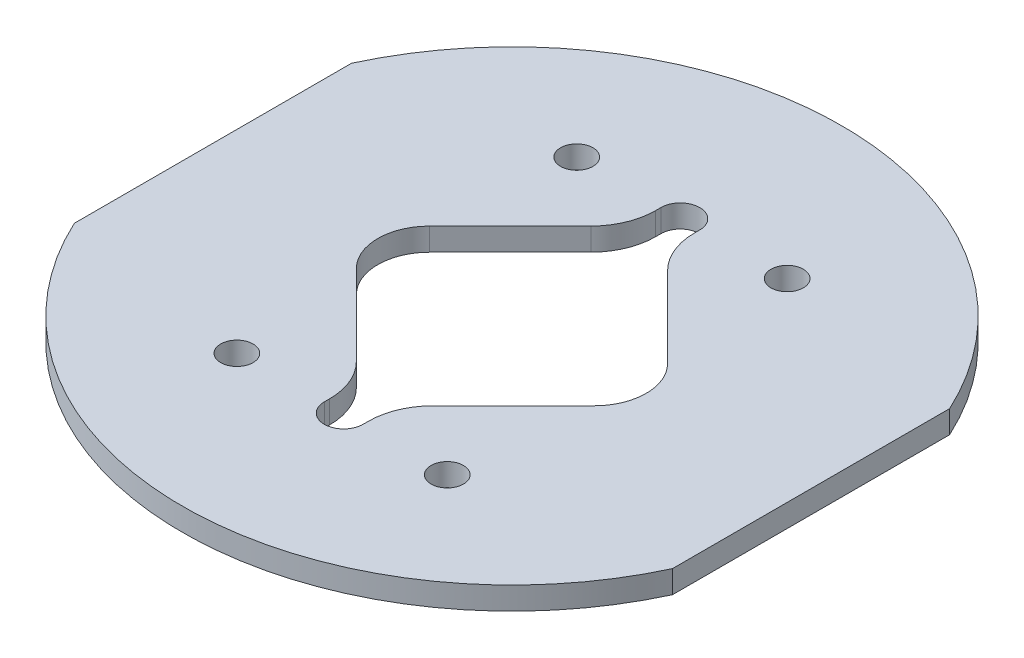
ISO-10303-21;
HEADER;
FILE_DESCRIPTION(('STEP AP214'),'2;1');
FILE_NAME('part.step','',(''),(''),'','','');
FILE_SCHEMA(('AUTOMOTIVE_DESIGN { 1 0 10303 214 1 1 1 1 }'));
ENDSEC;
DATA;
#1=APPLICATION_CONTEXT('core data for automotive mechanical design processes');
#2=APPLICATION_PROTOCOL_DEFINITION('international standard','automotive_design',2000,#1);
#3=PRODUCT_CONTEXT('',#1,'mechanical');
#4=PRODUCT('Part','Part','',(#3));
#5=PRODUCT_RELATED_PRODUCT_CATEGORY('part','',(#4));
#6=PRODUCT_DEFINITION_FORMATION('','',#4);
#7=PRODUCT_DEFINITION_CONTEXT('part definition',#1,'design');
#8=PRODUCT_DEFINITION('design','',#6,#7);
#9=PRODUCT_DEFINITION_SHAPE('','',#8);
#10=(LENGTH_UNIT() NAMED_UNIT(*) SI_UNIT(.MILLI.,.METRE.));
#11=(NAMED_UNIT(*) PLANE_ANGLE_UNIT() SI_UNIT($,.RADIAN.));
#12=(NAMED_UNIT(*) SI_UNIT($,.STERADIAN.) SOLID_ANGLE_UNIT());
#13=UNCERTAINTY_MEASURE_WITH_UNIT(LENGTH_MEASURE(1.E-05),#10,'distance_accuracy_value','');
#14=(GEOMETRIC_REPRESENTATION_CONTEXT(3) GLOBAL_UNCERTAINTY_ASSIGNED_CONTEXT((#13)) GLOBAL_UNIT_ASSIGNED_CONTEXT((#10,
#11,#12)) REPRESENTATION_CONTEXT('',''));
#15=CARTESIAN_POINT('',(0.,0.,0.));
#16=DIRECTION('',(0.,0.,1.));
#17=DIRECTION('',(1.,0.,0.));
#18=AXIS2_PLACEMENT_3D('',#15,#16,#17);
#19=CARTESIAN_POINT('',(0.,1.75,0.));
#20=DIRECTION('',(0.,-1.,0.));
#21=DIRECTION('',(0.,0.,-1.));
#22=AXIS2_PLACEMENT_3D('',#19,#20,#21);
#23=CYLINDRICAL_SURFACE('',#22,25.46);
#24=CARTESIAN_POINT('',(0.,0.,0.));
#25=DIRECTION('',(0.,1.,0.));
#26=DIRECTION('',(0.,0.,-1.));
#27=AXIS2_PLACEMENT_3D('',#24,#25,#26);
#28=CIRCLE('',#27,25.46);
#29=CARTESIAN_POINT('',(-23.1,0.,10.7052136830612));
#30=VERTEX_POINT('',#29);
#31=CARTESIAN_POINT('',(23.1,0.,10.7052136830612));
#32=VERTEX_POINT('',#31);
#33=EDGE_CURVE('E241',#30,#32,#28,.T.);
#34=ORIENTED_EDGE('',*,*,#33,.T.);
#35=DIRECTION('',(0.,-1.,0.));
#36=VECTOR('',#35,1.);
#37=CARTESIAN_POINT('',(23.1,1.75,10.7052136830612));
#38=LINE('',#37,#36);
#39=CARTESIAN_POINT('',(23.1,1.75,10.7052136830612));
#40=VERTEX_POINT('',#39);
#41=EDGE_CURVE('E275',#40,#32,#38,.T.);
#42=ORIENTED_EDGE('',*,*,#41,.F.);
#43=CARTESIAN_POINT('',(0.,1.75,0.));
#44=DIRECTION('',(0.,1.,0.));
#45=DIRECTION('',(0.,0.,-1.));
#46=AXIS2_PLACEMENT_3D('',#43,#44,#45);
#47=CIRCLE('',#46,25.46);
#48=CARTESIAN_POINT('',(-23.1,1.75,10.7052136830612));
#49=VERTEX_POINT('',#48);
#50=EDGE_CURVE('E249',#49,#40,#47,.T.);
#51=ORIENTED_EDGE('',*,*,#50,.F.);
#52=DIRECTION('',(0.,-1.,0.));
#53=VECTOR('',#52,1.);
#54=CARTESIAN_POINT('',(-23.1,1.75,10.7052136830612));
#55=LINE('',#54,#53);
#56=EDGE_CURVE('E259',#49,#30,#55,.T.);
#57=ORIENTED_EDGE('',*,*,#56,.T.);
#58=EDGE_LOOP('',(#34,#42,#51,#57));
#59=FACE_BOUND('',#58,.T.);
#60=ADVANCED_FACE('F37',(#59),#23,.T.);
#61=CARTESIAN_POINT('',(23.1,1.75,-10.7052136830612));
#62=DIRECTION('',(-1.,0.,0.));
#63=DIRECTION('',(0.,0.,1.));
#64=AXIS2_PLACEMENT_3D('',#61,#62,#63);
#65=PLANE('',#64);
#66=DIRECTION('',(0.,0.,-1.));
#67=VECTOR('',#66,1.);
#68=CARTESIAN_POINT('',(23.1,0.,-10.7052136830612));
#69=LINE('',#68,#67);
#70=CARTESIAN_POINT('',(23.1,0.,-10.7052136830612));
#71=VERTEX_POINT('',#70);
#72=EDGE_CURVE('E262',#32,#71,#69,.T.);
#73=ORIENTED_EDGE('',*,*,#72,.T.);
#74=DIRECTION('',(0.,-1.,0.));
#75=VECTOR('',#74,1.);
#76=CARTESIAN_POINT('',(23.1,1.75,-10.7052136830612));
#77=LINE('',#76,#75);
#78=CARTESIAN_POINT('',(23.1,1.75,-10.7052136830612));
#79=VERTEX_POINT('',#78);
#80=EDGE_CURVE('E272',#79,#71,#77,.T.);
#81=ORIENTED_EDGE('',*,*,#80,.F.);
#82=DIRECTION('',(0.,0.,-1.));
#83=VECTOR('',#82,1.);
#84=CARTESIAN_POINT('',(23.1,1.75,-10.7052136830612));
#85=LINE('',#84,#83);
#86=EDGE_CURVE('E252',#40,#79,#85,.T.);
#87=ORIENTED_EDGE('',*,*,#86,.F.);
#88=ORIENTED_EDGE('',*,*,#41,.T.);
#89=EDGE_LOOP('',(#73,#81,#87,#88));
#90=FACE_BOUND('',#89,.T.);
#91=ADVANCED_FACE('F396',(#90),#65,.F.);
#92=CARTESIAN_POINT('',(0.,1.75,0.));
#93=DIRECTION('',(0.,-1.,0.));
#94=DIRECTION('',(0.,0.,-1.));
#95=AXIS2_PLACEMENT_3D('',#92,#93,#94);
#96=CYLINDRICAL_SURFACE('',#95,25.46);
#97=CARTESIAN_POINT('',(0.,0.,0.));
#98=DIRECTION('',(0.,1.,0.));
#99=DIRECTION('',(0.,0.,-1.));
#100=AXIS2_PLACEMENT_3D('',#97,#98,#99);
#101=CIRCLE('',#100,25.46);
#102=CARTESIAN_POINT('',(-23.1,0.,-10.7052136830612));
#103=VERTEX_POINT('',#102);
#104=EDGE_CURVE('E264',#71,#103,#101,.T.);
#105=ORIENTED_EDGE('',*,*,#104,.T.);
#106=DIRECTION('',(0.,-1.,0.));
#107=VECTOR('',#106,1.);
#108=CARTESIAN_POINT('',(-23.1,1.75,-10.7052136830612));
#109=LINE('',#108,#107);
#110=CARTESIAN_POINT('',(-23.1,1.75,-10.7052136830612));
#111=VERTEX_POINT('',#110);
#112=EDGE_CURVE('E269',#111,#103,#109,.T.);
#113=ORIENTED_EDGE('',*,*,#112,.F.);
#114=CARTESIAN_POINT('',(0.,1.75,0.));
#115=DIRECTION('',(0.,1.,0.));
#116=DIRECTION('',(0.,0.,-1.));
#117=AXIS2_PLACEMENT_3D('',#114,#115,#116);
#118=CIRCLE('',#117,25.46);
#119=EDGE_CURVE('E255',#79,#111,#118,.T.);
#120=ORIENTED_EDGE('',*,*,#119,.F.);
#121=ORIENTED_EDGE('',*,*,#80,.T.);
#122=EDGE_LOOP('',(#105,#113,#120,#121));
#123=FACE_BOUND('',#122,.T.);
#124=ADVANCED_FACE('F402',(#123),#96,.T.);
#125=CARTESIAN_POINT('',(-23.1,1.75,10.7052136830612));
#126=DIRECTION('',(1.,0.,0.));
#127=DIRECTION('',(0.,0.,-1.));
#128=AXIS2_PLACEMENT_3D('',#125,#126,#127);
#129=PLANE('',#128);
#130=DIRECTION('',(0.,0.,1.));
#131=VECTOR('',#130,1.);
#132=CARTESIAN_POINT('',(-23.1,0.,10.7052136830612));
#133=LINE('',#132,#131);
#134=EDGE_CURVE('E253',#103,#30,#133,.T.);
#135=ORIENTED_EDGE('',*,*,#134,.T.);
#136=ORIENTED_EDGE('',*,*,#56,.F.);
#137=DIRECTION('',(0.,0.,1.));
#138=VECTOR('',#137,1.);
#139=CARTESIAN_POINT('',(-23.1,1.75,10.7052136830612));
#140=LINE('',#139,#138);
#141=EDGE_CURVE('E257',#111,#49,#140,.T.);
#142=ORIENTED_EDGE('',*,*,#141,.F.);
#143=ORIENTED_EDGE('',*,*,#112,.T.);
#144=EDGE_LOOP('',(#135,#136,#142,#143));
#145=FACE_BOUND('',#144,.T.);
#146=ADVANCED_FACE('F469',(#145),#129,.F.);
#147=CARTESIAN_POINT('',(0.,1.75,0.));
#148=DIRECTION('',(0.,-1.,0.));
#149=DIRECTION('',(0.,0.,-1.));
#150=AXIS2_PLACEMENT_3D('',#147,#148,#149);
#151=PLANE('',#150);
#152=CARTESIAN_POINT('',(8.125,1.75,13.125));
#153=DIRECTION('',(0.,1.,0.));
#154=DIRECTION('',(0.,0.,-1.));
#155=AXIS2_PLACEMENT_3D('',#152,#153,#154);
#156=CIRCLE('',#155,1.25);
#157=CARTESIAN_POINT('',(8.125,1.75,11.875));
#158=VERTEX_POINT('',#157);
#159=EDGE_CURVE('E447',#158,#158,#156,.T.);
#160=ORIENTED_EDGE('',*,*,#159,.F.);
#161=EDGE_LOOP('',(#160));
#162=FACE_BOUND('',#161,.T.);
#163=CARTESIAN_POINT('',(-8.125,1.75,13.125));
#164=DIRECTION('',(0.,1.,0.));
#165=DIRECTION('',(0.,0.,-1.));
#166=AXIS2_PLACEMENT_3D('',#163,#164,#165);
#167=CIRCLE('',#166,1.25);
#168=CARTESIAN_POINT('',(-8.125,1.75,11.875));
#169=VERTEX_POINT('',#168);
#170=EDGE_CURVE('E453',#169,#169,#167,.T.);
#171=ORIENTED_EDGE('',*,*,#170,.F.);
#172=EDGE_LOOP('',(#171));
#173=FACE_BOUND('',#172,.T.);
#174=CARTESIAN_POINT('',(-8.125,1.75,-13.125));
#175=DIRECTION('',(0.,1.,0.));
#176=DIRECTION('',(0.,0.,1.));
#177=AXIS2_PLACEMENT_3D('',#174,#175,#176);
#178=CIRCLE('',#177,1.25);
#179=CARTESIAN_POINT('',(-8.125,1.75,-11.875));
#180=VERTEX_POINT('',#179);
#181=EDGE_CURVE('E460',#180,#180,#178,.T.);
#182=ORIENTED_EDGE('',*,*,#181,.F.);
#183=EDGE_LOOP('',(#182));
#184=FACE_BOUND('',#183,.T.);
#185=CARTESIAN_POINT('',(8.125,1.75,-13.125));
#186=DIRECTION('',(0.,1.,0.));
#187=DIRECTION('',(0.,0.,1.));
#188=AXIS2_PLACEMENT_3D('',#185,#186,#187);
#189=CIRCLE('',#188,1.25);
#190=CARTESIAN_POINT('',(8.125,1.75,-11.875));
#191=VERTEX_POINT('',#190);
#192=EDGE_CURVE('E209',#191,#191,#189,.T.);
#193=ORIENTED_EDGE('',*,*,#192,.F.);
#194=EDGE_LOOP('',(#193));
#195=FACE_BOUND('',#194,.T.);
#196=DIRECTION('',(0.,0.,1.));
#197=VECTOR('',#196,1.);
#198=CARTESIAN_POINT('',(-1.5,1.75,-13.));
#199=LINE('',#198,#197);
#200=CARTESIAN_POINT('',(-1.49999999999998,1.75,12.5918830920368));
#201=VERTEX_POINT('',#200);
#202=CARTESIAN_POINT('',(-1.49999999999998,1.75,13.));
#203=VERTEX_POINT('',#202);
#204=EDGE_CURVE('E217',#201,#203,#199,.T.);
#205=ORIENTED_EDGE('',*,*,#204,.F.);
#206=CARTESIAN_POINT('',(-6.49999999999998,1.75,12.5918830920368));
#207=DIRECTION('',(0.,-1.,0.));
#208=DIRECTION('',(0.,0.,-1.));
#209=AXIS2_PLACEMENT_3D('',#206,#207,#208);
#210=CIRCLE('',#209,5.);
#211=CARTESIAN_POINT('',(-2.96446609406724,1.75,9.05634918610406));
#212=VERTEX_POINT('',#211);
#213=EDGE_CURVE('E298',#201,#212,#210,.F.);
#214=ORIENTED_EDGE('',*,*,#213,.T.);
#215=DIRECTION('',(0.707106781186548,0.,0.707106781186547));
#216=VECTOR('',#215,1.);
#217=CARTESIAN_POINT('',(0.,1.75,12.0208152801713));
#218=LINE('',#217,#216);
#219=CARTESIAN_POINT('',(-9.19238815542512,1.75,2.82842712474619));
#220=VERTEX_POINT('',#219);
#221=EDGE_CURVE('E235',#220,#212,#218,.T.);
#222=ORIENTED_EDGE('',*,*,#221,.F.);
#223=CARTESIAN_POINT('',(-6.36396103067893,1.75,0.));
#224=DIRECTION('',(0.,-1.,0.));
#225=DIRECTION('',(0.,0.,-1.));
#226=AXIS2_PLACEMENT_3D('',#223,#224,#225);
#227=CIRCLE('',#226,4.);
#228=CARTESIAN_POINT('',(-9.19238815542512,1.75,-2.82842712474619));
#229=VERTEX_POINT('',#228);
#230=EDGE_CURVE('E45',#220,#229,#227,.T.);
#231=ORIENTED_EDGE('',*,*,#230,.T.);
#232=DIRECTION('',(-0.707106781186548,0.,0.707106781186548));
#233=VECTOR('',#232,1.);
#234=CARTESIAN_POINT('',(-12.0208152801713,1.75,0.));
#235=LINE('',#234,#233);
#236=CARTESIAN_POINT('',(-2.96446609406725,1.75,-9.05634918610406));
#237=VERTEX_POINT('',#236);
#238=EDGE_CURVE('E246',#237,#229,#235,.T.);
#239=ORIENTED_EDGE('',*,*,#238,.F.);
#240=CARTESIAN_POINT('',(-6.5,1.75,-12.5918830920368));
#241=DIRECTION('',(0.,-1.,0.));
#242=DIRECTION('',(0.,0.,-1.));
#243=AXIS2_PLACEMENT_3D('',#240,#241,#242);
#244=CIRCLE('',#243,5.);
#245=CARTESIAN_POINT('',(-1.5,1.75,-12.5918830920368));
#246=VERTEX_POINT('',#245);
#247=EDGE_CURVE('E291',#237,#246,#244,.F.);
#248=ORIENTED_EDGE('',*,*,#247,.T.);
#249=CARTESIAN_POINT('',(-1.5,1.75,-13.));
#250=VERTEX_POINT('',#249);
#251=EDGE_CURVE('E219',#250,#246,#199,.T.);
#252=ORIENTED_EDGE('',*,*,#251,.F.);
#253=CARTESIAN_POINT('',(0.,1.75,-13.));
#254=DIRECTION('',(0.,1.,0.));
#255=DIRECTION('',(0.,0.,1.));
#256=AXIS2_PLACEMENT_3D('',#253,#254,#255);
#257=CIRCLE('',#256,1.5);
#258=CARTESIAN_POINT('',(1.5,1.75,-13.));
#259=VERTEX_POINT('',#258);
#260=EDGE_CURVE('E181',#259,#250,#257,.T.);
#261=ORIENTED_EDGE('',*,*,#260,.F.);
#262=DIRECTION('',(0.,0.,-1.));
#263=VECTOR('',#262,1.);
#264=CARTESIAN_POINT('',(1.5,1.75,13.));
#265=LINE('',#264,#263);
#266=CARTESIAN_POINT('',(1.5,1.75,-12.5918830920368));
#267=VERTEX_POINT('',#266);
#268=EDGE_CURVE('E206',#267,#259,#265,.T.);
#269=ORIENTED_EDGE('',*,*,#268,.F.);
#270=CARTESIAN_POINT('',(6.5,1.75,-12.5918830920368));
#271=DIRECTION('',(0.,-1.,0.));
#272=DIRECTION('',(0.,0.,-1.));
#273=AXIS2_PLACEMENT_3D('',#270,#271,#272);
#274=CIRCLE('',#273,5.);
#275=CARTESIAN_POINT('',(2.96446609406726,1.75,-9.05634918610405));
#276=VERTEX_POINT('',#275);
#277=EDGE_CURVE('E293',#267,#276,#274,.F.);
#278=ORIENTED_EDGE('',*,*,#277,.T.);
#279=DIRECTION('',(-0.707106781186548,0.,-0.707106781186548));
#280=VECTOR('',#279,1.);
#281=CARTESIAN_POINT('',(12.0208152801713,1.75,0.));
#282=LINE('',#281,#280);
#283=CARTESIAN_POINT('',(9.19238815542512,1.75,-2.82842712474619));
#284=VERTEX_POINT('',#283);
#285=EDGE_CURVE('E244',#284,#276,#282,.T.);
#286=ORIENTED_EDGE('',*,*,#285,.F.);
#287=CARTESIAN_POINT('',(6.36396103067893,1.75,0.));
#288=DIRECTION('',(0.,-1.,0.));
#289=DIRECTION('',(0.,0.,-1.));
#290=AXIS2_PLACEMENT_3D('',#287,#288,#289);
#291=CIRCLE('',#290,4.);
#292=CARTESIAN_POINT('',(9.19238815542512,1.75,2.82842712474619));
#293=VERTEX_POINT('',#292);
#294=EDGE_CURVE('E324',#284,#293,#291,.T.);
#295=ORIENTED_EDGE('',*,*,#294,.T.);
#296=DIRECTION('',(0.707106781186548,0.,-0.707106781186547));
#297=VECTOR('',#296,1.);
#298=CARTESIAN_POINT('',(0.,1.75,12.0208152801713));
#299=LINE('',#298,#297);
#300=CARTESIAN_POINT('',(2.96446609406726,1.75,9.05634918610405));
#301=VERTEX_POINT('',#300);
#302=EDGE_CURVE('E226',#301,#293,#299,.T.);
#303=ORIENTED_EDGE('',*,*,#302,.F.);
#304=CARTESIAN_POINT('',(6.5,1.75,12.5918830920368));
#305=DIRECTION('',(0.,-1.,0.));
#306=DIRECTION('',(0.,0.,-1.));
#307=AXIS2_PLACEMENT_3D('',#304,#305,#306);
#308=CIRCLE('',#307,5.);
#309=CARTESIAN_POINT('',(1.5,1.75,12.5918830920368));
#310=VERTEX_POINT('',#309);
#311=EDGE_CURVE('E296',#301,#310,#308,.F.);
#312=ORIENTED_EDGE('',*,*,#311,.T.);
#313=CARTESIAN_POINT('',(1.5,1.75,13.));
#314=VERTEX_POINT('',#313);
#315=EDGE_CURVE('E203',#314,#310,#265,.T.);
#316=ORIENTED_EDGE('',*,*,#315,.F.);
#317=CARTESIAN_POINT('',(0.,1.75,13.));
#318=DIRECTION('',(0.,1.,0.));
#319=DIRECTION('',(0.,0.,-1.));
#320=AXIS2_PLACEMENT_3D('',#317,#318,#319);
#321=CIRCLE('',#320,1.49999999999999);
#322=EDGE_CURVE('E221',#203,#314,#321,.T.);
#323=ORIENTED_EDGE('',*,*,#322,.F.);
#324=EDGE_LOOP('',(#205,#214,#222,#231,#239,#248,#252,#261,#269,#278,#286,#295,#303,#312,#316,#323));
#325=FACE_BOUND('',#324,.T.);
#326=ORIENTED_EDGE('',*,*,#50,.T.);
#327=ORIENTED_EDGE('',*,*,#86,.T.);
#328=ORIENTED_EDGE('',*,*,#119,.T.);
#329=ORIENTED_EDGE('',*,*,#141,.T.);
#330=EDGE_LOOP('',(#326,#327,#328,#329));
#331=FACE_BOUND('',#330,.T.);
#332=ADVANCED_FACE('F341',(#162,#173,#184,#195,#325,#331),#151,.F.);
#333=CARTESIAN_POINT('',(0.,0.,0.));
#334=DIRECTION('',(0.,-1.,0.));
#335=DIRECTION('',(0.,0.,-1.));
#336=AXIS2_PLACEMENT_3D('',#333,#334,#335);
#337=PLANE('',#336);
#338=CARTESIAN_POINT('',(8.125,0.,13.125));
#339=DIRECTION('',(0.,1.,0.));
#340=DIRECTION('',(0.,0.,-1.));
#341=AXIS2_PLACEMENT_3D('',#338,#339,#340);
#342=CIRCLE('',#341,1.25);
#343=CARTESIAN_POINT('',(8.125,0.,11.875));
#344=VERTEX_POINT('',#343);
#345=EDGE_CURVE('E444',#344,#344,#342,.T.);
#346=ORIENTED_EDGE('',*,*,#345,.T.);
#347=EDGE_LOOP('',(#346));
#348=FACE_BOUND('',#347,.T.);
#349=CARTESIAN_POINT('',(-8.125,0.,13.125));
#350=DIRECTION('',(0.,1.,0.));
#351=DIRECTION('',(0.,0.,-1.));
#352=AXIS2_PLACEMENT_3D('',#349,#350,#351);
#353=CIRCLE('',#352,1.25);
#354=CARTESIAN_POINT('',(-8.125,0.,11.875));
#355=VERTEX_POINT('',#354);
#356=EDGE_CURVE('E449',#355,#355,#353,.T.);
#357=ORIENTED_EDGE('',*,*,#356,.T.);
#358=EDGE_LOOP('',(#357));
#359=FACE_BOUND('',#358,.T.);
#360=CARTESIAN_POINT('',(-8.125,0.,-13.125));
#361=DIRECTION('',(0.,1.,0.));
#362=DIRECTION('',(0.,0.,1.));
#363=AXIS2_PLACEMENT_3D('',#360,#361,#362);
#364=CIRCLE('',#363,1.25);
#365=CARTESIAN_POINT('',(-8.125,0.,-11.875));
#366=VERTEX_POINT('',#365);
#367=EDGE_CURVE('E218',#366,#366,#364,.T.);
#368=ORIENTED_EDGE('',*,*,#367,.T.);
#369=EDGE_LOOP('',(#368));
#370=FACE_BOUND('',#369,.T.);
#371=CARTESIAN_POINT('',(8.125,0.,-13.125));
#372=DIRECTION('',(0.,1.,0.));
#373=DIRECTION('',(0.,0.,1.));
#374=AXIS2_PLACEMENT_3D('',#371,#372,#373);
#375=CIRCLE('',#374,1.25);
#376=CARTESIAN_POINT('',(8.125,0.,-11.875));
#377=VERTEX_POINT('',#376);
#378=EDGE_CURVE('E462',#377,#377,#375,.T.);
#379=ORIENTED_EDGE('',*,*,#378,.T.);
#380=EDGE_LOOP('',(#379));
#381=FACE_BOUND('',#380,.T.);
#382=DIRECTION('',(-0.707106781186548,0.,0.707106781186548));
#383=VECTOR('',#382,1.);
#384=CARTESIAN_POINT('',(-12.0208152801713,0.,0.));
#385=LINE('',#384,#383);
#386=CARTESIAN_POINT('',(-2.96446609406725,0.,-9.05634918610406));
#387=VERTEX_POINT('',#386);
#388=CARTESIAN_POINT('',(-9.19238815542512,0.,-2.82842712474619));
#389=VERTEX_POINT('',#388);
#390=EDGE_CURVE('E237',#387,#389,#385,.T.);
#391=ORIENTED_EDGE('',*,*,#390,.T.);
#392=CARTESIAN_POINT('',(-6.36396103067893,0.,0.));
#393=DIRECTION('',(0.,-1.,0.));
#394=DIRECTION('',(0.,0.,-1.));
#395=AXIS2_PLACEMENT_3D('',#392,#393,#394);
#396=CIRCLE('',#395,4.);
#397=CARTESIAN_POINT('',(-9.19238815542512,0.,2.82842712474619));
#398=VERTEX_POINT('',#397);
#399=EDGE_CURVE('E11',#389,#398,#396,.F.);
#400=ORIENTED_EDGE('',*,*,#399,.T.);
#401=DIRECTION('',(0.707106781186548,0.,0.707106781186547));
#402=VECTOR('',#401,1.);
#403=CARTESIAN_POINT('',(0.,0.,12.0208152801713));
#404=LINE('',#403,#402);
#405=CARTESIAN_POINT('',(-2.96446609406724,0.,9.05634918610406));
#406=VERTEX_POINT('',#405);
#407=EDGE_CURVE('E239',#398,#406,#404,.T.);
#408=ORIENTED_EDGE('',*,*,#407,.T.);
#409=CARTESIAN_POINT('',(-6.49999999999998,0.,12.5918830920368));
#410=DIRECTION('',(0.,-1.,0.));
#411=DIRECTION('',(0.,0.,-1.));
#412=AXIS2_PLACEMENT_3D('',#409,#410,#411);
#413=CIRCLE('',#412,5.);
#414=CARTESIAN_POINT('',(-1.49999999999998,0.,12.5918830920368));
#415=VERTEX_POINT('',#414);
#416=EDGE_CURVE('E287',#406,#415,#413,.T.);
#417=ORIENTED_EDGE('',*,*,#416,.T.);
#418=DIRECTION('',(0.,0.,1.));
#419=VECTOR('',#418,1.);
#420=CARTESIAN_POINT('',(-1.5,0.,-13.));
#421=LINE('',#420,#419);
#422=CARTESIAN_POINT('',(-1.49999999999998,0.,13.));
#423=VERTEX_POINT('',#422);
#424=EDGE_CURVE('E196',#415,#423,#421,.T.);
#425=ORIENTED_EDGE('',*,*,#424,.T.);
#426=CARTESIAN_POINT('',(0.,0.,13.));
#427=DIRECTION('',(0.,1.,0.));
#428=DIRECTION('',(0.,0.,-1.));
#429=AXIS2_PLACEMENT_3D('',#426,#427,#428);
#430=CIRCLE('',#429,1.49999999999999);
#431=CARTESIAN_POINT('',(1.5,0.,13.));
#432=VERTEX_POINT('',#431);
#433=EDGE_CURVE('E195',#423,#432,#430,.T.);
#434=ORIENTED_EDGE('',*,*,#433,.T.);
#435=DIRECTION('',(0.,0.,-1.));
#436=VECTOR('',#435,1.);
#437=CARTESIAN_POINT('',(1.5,0.,13.));
#438=LINE('',#437,#436);
#439=CARTESIAN_POINT('',(1.5,0.,12.5918830920368));
#440=VERTEX_POINT('',#439);
#441=EDGE_CURVE('E186',#432,#440,#438,.T.);
#442=ORIENTED_EDGE('',*,*,#441,.T.);
#443=CARTESIAN_POINT('',(6.5,0.,12.5918830920368));
#444=DIRECTION('',(0.,-1.,0.));
#445=DIRECTION('',(0.,0.,-1.));
#446=AXIS2_PLACEMENT_3D('',#443,#444,#445);
#447=CIRCLE('',#446,5.);
#448=CARTESIAN_POINT('',(2.96446609406726,0.,9.05634918610405));
#449=VERTEX_POINT('',#448);
#450=EDGE_CURVE('E285',#440,#449,#447,.T.);
#451=ORIENTED_EDGE('',*,*,#450,.T.);
#452=DIRECTION('',(0.707106781186548,0.,-0.707106781186547));
#453=VECTOR('',#452,1.);
#454=CARTESIAN_POINT('',(0.,0.,12.0208152801713));
#455=LINE('',#454,#453);
#456=CARTESIAN_POINT('',(9.19238815542512,0.,2.82842712474619));
#457=VERTEX_POINT('',#456);
#458=EDGE_CURVE('E231',#449,#457,#455,.T.);
#459=ORIENTED_EDGE('',*,*,#458,.T.);
#460=CARTESIAN_POINT('',(6.36396103067893,0.,0.));
#461=DIRECTION('',(0.,-1.,0.));
#462=DIRECTION('',(0.,0.,-1.));
#463=AXIS2_PLACEMENT_3D('',#460,#461,#462);
#464=CIRCLE('',#463,4.);
#465=CARTESIAN_POINT('',(9.19238815542512,0.,-2.82842712474619));
#466=VERTEX_POINT('',#465);
#467=EDGE_CURVE('E326',#457,#466,#464,.F.);
#468=ORIENTED_EDGE('',*,*,#467,.T.);
#469=DIRECTION('',(-0.707106781186548,0.,-0.707106781186548));
#470=VECTOR('',#469,1.);
#471=CARTESIAN_POINT('',(12.0208152801713,0.,0.));
#472=LINE('',#471,#470);
#473=CARTESIAN_POINT('',(2.96446609406726,0.,-9.05634918610405));
#474=VERTEX_POINT('',#473);
#475=EDGE_CURVE('E234',#466,#474,#472,.T.);
#476=ORIENTED_EDGE('',*,*,#475,.T.);
#477=CARTESIAN_POINT('',(6.5,0.,-12.5918830920368));
#478=DIRECTION('',(0.,-1.,0.));
#479=DIRECTION('',(0.,0.,-1.));
#480=AXIS2_PLACEMENT_3D('',#477,#478,#479);
#481=CIRCLE('',#480,5.);
#482=CARTESIAN_POINT('',(1.5,0.,-12.5918830920368));
#483=VERTEX_POINT('',#482);
#484=EDGE_CURVE('E283',#474,#483,#481,.T.);
#485=ORIENTED_EDGE('',*,*,#484,.T.);
#486=CARTESIAN_POINT('',(1.5,0.,-13.));
#487=VERTEX_POINT('',#486);
#488=EDGE_CURVE('E201',#483,#487,#438,.T.);
#489=ORIENTED_EDGE('',*,*,#488,.T.);
#490=CARTESIAN_POINT('',(0.,0.,-13.));
#491=DIRECTION('',(0.,1.,0.));
#492=DIRECTION('',(0.,0.,1.));
#493=AXIS2_PLACEMENT_3D('',#490,#491,#492);
#494=CIRCLE('',#493,1.5);
#495=CARTESIAN_POINT('',(-1.5,0.,-13.));
#496=VERTEX_POINT('',#495);
#497=EDGE_CURVE('E179',#487,#496,#494,.T.);
#498=ORIENTED_EDGE('',*,*,#497,.T.);
#499=CARTESIAN_POINT('',(-1.5,0.,-12.5918830920368));
#500=VERTEX_POINT('',#499);
#501=EDGE_CURVE('E189',#496,#500,#421,.T.);
#502=ORIENTED_EDGE('',*,*,#501,.T.);
#503=CARTESIAN_POINT('',(-6.5,0.,-12.5918830920368));
#504=DIRECTION('',(0.,-1.,0.));
#505=DIRECTION('',(0.,0.,-1.));
#506=AXIS2_PLACEMENT_3D('',#503,#504,#505);
#507=CIRCLE('',#506,5.);
#508=EDGE_CURVE('E281',#500,#387,#507,.T.);
#509=ORIENTED_EDGE('',*,*,#508,.T.);
#510=EDGE_LOOP('',(#391,#400,#408,#417,#425,#434,#442,#451,#459,#468,#476,#485,#489,#498,#502,#509));
#511=FACE_BOUND('',#510,.T.);
#512=ORIENTED_EDGE('',*,*,#33,.F.);
#513=ORIENTED_EDGE('',*,*,#134,.F.);
#514=ORIENTED_EDGE('',*,*,#104,.F.);
#515=ORIENTED_EDGE('',*,*,#72,.F.);
#516=EDGE_LOOP('',(#512,#513,#514,#515));
#517=FACE_BOUND('',#516,.T.);
#518=ADVANCED_FACE('F198',(#348,#359,#370,#381,#511,#517),#337,.T.);
#519=CARTESIAN_POINT('',(0.,0.,12.0208152801713));
#520=DIRECTION('',(0.707106781186547,0.,0.707106781186548));
#521=DIRECTION('',(0.707106781186548,0.,-0.707106781186547));
#522=AXIS2_PLACEMENT_3D('',#519,#520,#521);
#523=PLANE('',#522);
#524=ORIENTED_EDGE('',*,*,#302,.T.);
#525=DIRECTION('',(0.,1.,0.));
#526=VECTOR('',#525,1.);
#527=CARTESIAN_POINT('',(9.19238815542512,0.,2.82842712474619));
#528=LINE('',#527,#526);
#529=EDGE_CURVE('E318',#293,#457,#528,.F.);
#530=ORIENTED_EDGE('',*,*,#529,.T.);
#531=ORIENTED_EDGE('',*,*,#458,.F.);
#532=DIRECTION('',(0.,1.,0.));
#533=VECTOR('',#532,1.);
#534=CARTESIAN_POINT('',(2.96446609406726,0.,9.05634918610405));
#535=LINE('',#534,#533);
#536=EDGE_CURVE('E301',#449,#301,#535,.T.);
#537=ORIENTED_EDGE('',*,*,#536,.T.);
#538=EDGE_LOOP('',(#524,#530,#531,#537));
#539=FACE_BOUND('',#538,.T.);
#540=ADVANCED_FACE('F344',(#539),#523,.F.);
#541=CARTESIAN_POINT('',(0.,0.,12.0208152801713));
#542=DIRECTION('',(-0.707106781186547,0.,0.707106781186548));
#543=DIRECTION('',(0.707106781186548,0.,0.707106781186547));
#544=AXIS2_PLACEMENT_3D('',#541,#542,#543);
#545=PLANE('',#544);
#546=ORIENTED_EDGE('',*,*,#407,.F.);
#547=DIRECTION('',(0.,1.,0.));
#548=VECTOR('',#547,1.);
#549=CARTESIAN_POINT('',(-9.19238815542512,1.75,2.82842712474619));
#550=LINE('',#549,#548);
#551=EDGE_CURVE('E320',#398,#220,#550,.T.);
#552=ORIENTED_EDGE('',*,*,#551,.T.);
#553=ORIENTED_EDGE('',*,*,#221,.T.);
#554=DIRECTION('',(0.,-1.,0.));
#555=VECTOR('',#554,1.);
#556=CARTESIAN_POINT('',(-2.96446609406724,0.,9.05634918610406));
#557=LINE('',#556,#555);
#558=EDGE_CURVE('E278',#212,#406,#557,.T.);
#559=ORIENTED_EDGE('',*,*,#558,.T.);
#560=EDGE_LOOP('',(#546,#552,#553,#559));
#561=FACE_BOUND('',#560,.T.);
#562=ADVANCED_FACE('F368',(#561),#545,.F.);
#563=CARTESIAN_POINT('',(-12.0208152801713,0.,0.));
#564=DIRECTION('',(-0.707106781186548,0.,-0.707106781186547));
#565=DIRECTION('',(-0.707106781186547,0.,0.707106781186548));
#566=AXIS2_PLACEMENT_3D('',#563,#564,#565);
#567=PLANE('',#566);
#568=ORIENTED_EDGE('',*,*,#238,.T.);
#569=DIRECTION('',(0.,1.,0.));
#570=VECTOR('',#569,1.);
#571=CARTESIAN_POINT('',(-9.19238815542512,0.,-2.82842712474619));
#572=LINE('',#571,#570);
#573=EDGE_CURVE('E58',#229,#389,#572,.F.);
#574=ORIENTED_EDGE('',*,*,#573,.T.);
#575=ORIENTED_EDGE('',*,*,#390,.F.);
#576=DIRECTION('',(0.,1.,0.));
#577=VECTOR('',#576,1.);
#578=CARTESIAN_POINT('',(-2.96446609406726,0.,-9.05634918610405));
#579=LINE('',#578,#577);
#580=EDGE_CURVE('E311',#387,#237,#579,.T.);
#581=ORIENTED_EDGE('',*,*,#580,.T.);
#582=EDGE_LOOP('',(#568,#574,#575,#581));
#583=FACE_BOUND('',#582,.T.);
#584=ADVANCED_FACE('F373',(#583),#567,.F.);
#585=CARTESIAN_POINT('',(12.0208152801713,0.,0.));
#586=DIRECTION('',(0.707106781186548,0.,-0.707106781186547));
#587=DIRECTION('',(-0.707106781186547,0.,-0.707106781186548));
#588=AXIS2_PLACEMENT_3D('',#585,#586,#587);
#589=PLANE('',#588);
#590=ORIENTED_EDGE('',*,*,#475,.F.);
#591=DIRECTION('',(0.,1.,0.));
#592=VECTOR('',#591,1.);
#593=CARTESIAN_POINT('',(9.19238815542512,1.75,-2.82842712474619));
#594=LINE('',#593,#592);
#595=EDGE_CURVE('E315',#466,#284,#594,.T.);
#596=ORIENTED_EDGE('',*,*,#595,.T.);
#597=ORIENTED_EDGE('',*,*,#285,.T.);
#598=DIRECTION('',(0.,-1.,0.));
#599=VECTOR('',#598,1.);
#600=CARTESIAN_POINT('',(2.96446609406726,0.,-9.05634918610405));
#601=LINE('',#600,#599);
#602=EDGE_CURVE('E306',#276,#474,#601,.T.);
#603=ORIENTED_EDGE('',*,*,#602,.T.);
#604=EDGE_LOOP('',(#590,#596,#597,#603));
#605=FACE_BOUND('',#604,.T.);
#606=ADVANCED_FACE('F335',(#605),#589,.F.);
#607=CARTESIAN_POINT('',(-1.5,0.,-13.));
#608=DIRECTION('',(-1.,0.,0.));
#609=DIRECTION('',(0.,0.,1.));
#610=AXIS2_PLACEMENT_3D('',#607,#608,#609);
#611=PLANE('',#610);
#612=ORIENTED_EDGE('',*,*,#251,.T.);
#613=DIRECTION('',(0.,1.,0.));
#614=VECTOR('',#613,1.);
#615=CARTESIAN_POINT('',(-1.5,0.,-12.5918830920368));
#616=LINE('',#615,#614);
#617=EDGE_CURVE('E192',#246,#500,#616,.F.);
#618=ORIENTED_EDGE('',*,*,#617,.T.);
#619=ORIENTED_EDGE('',*,*,#501,.F.);
#620=DIRECTION('',(0.,1.,0.));
#621=VECTOR('',#620,1.);
#622=CARTESIAN_POINT('',(-1.5,0.,-13.));
#623=LINE('',#622,#621);
#624=EDGE_CURVE('E174',#496,#250,#623,.T.);
#625=ORIENTED_EDGE('',*,*,#624,.T.);
#626=EDGE_LOOP('',(#612,#618,#619,#625));
#627=FACE_BOUND('',#626,.T.);
#628=ADVANCED_FACE('F190',(#627),#611,.F.);
#629=CARTESIAN_POINT('',(1.5,0.,13.));
#630=DIRECTION('',(1.,0.,0.));
#631=DIRECTION('',(0.,0.,-1.));
#632=AXIS2_PLACEMENT_3D('',#629,#630,#631);
#633=PLANE('',#632);
#634=ORIENTED_EDGE('',*,*,#488,.F.);
#635=DIRECTION('',(0.,-1.,0.));
#636=VECTOR('',#635,1.);
#637=CARTESIAN_POINT('',(1.5,0.,-12.5918830920368));
#638=LINE('',#637,#636);
#639=EDGE_CURVE('E309',#483,#267,#638,.F.);
#640=ORIENTED_EDGE('',*,*,#639,.T.);
#641=ORIENTED_EDGE('',*,*,#268,.T.);
#642=DIRECTION('',(0.,1.,0.));
#643=VECTOR('',#642,1.);
#644=CARTESIAN_POINT('',(1.5,0.,-13.));
#645=LINE('',#644,#643);
#646=EDGE_CURVE('E224',#487,#259,#645,.T.);
#647=ORIENTED_EDGE('',*,*,#646,.F.);
#648=EDGE_LOOP('',(#634,#640,#641,#647));
#649=FACE_BOUND('',#648,.T.);
#650=ADVANCED_FACE('F382',(#649),#633,.F.);
#651=CARTESIAN_POINT('',(0.,0.,-13.));
#652=DIRECTION('',(0.,1.,0.));
#653=DIRECTION('',(0.,0.,1.));
#654=AXIS2_PLACEMENT_3D('',#651,#652,#653);
#655=CYLINDRICAL_SURFACE('',#654,1.5);
#656=ORIENTED_EDGE('',*,*,#260,.T.);
#657=ORIENTED_EDGE('',*,*,#624,.F.);
#658=ORIENTED_EDGE('',*,*,#497,.F.);
#659=ORIENTED_EDGE('',*,*,#646,.T.);
#660=EDGE_LOOP('',(#656,#657,#658,#659));
#661=FACE_BOUND('',#660,.T.);
#662=ADVANCED_FACE('F176',(#661),#655,.F.);
#663=ORIENTED_EDGE('',*,*,#424,.F.);
#664=DIRECTION('',(0.,-1.,0.));
#665=VECTOR('',#664,1.);
#666=CARTESIAN_POINT('',(-1.49999999999998,0.,12.5918830920368));
#667=LINE('',#666,#665);
#668=EDGE_CURVE('E289',#415,#201,#667,.F.);
#669=ORIENTED_EDGE('',*,*,#668,.T.);
#670=ORIENTED_EDGE('',*,*,#204,.T.);
#671=DIRECTION('',(0.,1.,0.));
#672=VECTOR('',#671,1.);
#673=CARTESIAN_POINT('',(-1.49999999999998,0.,13.));
#674=LINE('',#673,#672);
#675=EDGE_CURVE('E185',#423,#203,#674,.T.);
#676=ORIENTED_EDGE('',*,*,#675,.F.);
#677=EDGE_LOOP('',(#663,#669,#670,#676));
#678=FACE_BOUND('',#677,.T.);
#679=ADVANCED_FACE('F389',(#678),#611,.F.);
#680=ORIENTED_EDGE('',*,*,#315,.T.);
#681=DIRECTION('',(0.,1.,0.));
#682=VECTOR('',#681,1.);
#683=CARTESIAN_POINT('',(1.5,0.,12.5918830920368));
#684=LINE('',#683,#682);
#685=EDGE_CURVE('E304',#310,#440,#684,.F.);
#686=ORIENTED_EDGE('',*,*,#685,.T.);
#687=ORIENTED_EDGE('',*,*,#441,.F.);
#688=DIRECTION('',(0.,1.,0.));
#689=VECTOR('',#688,1.);
#690=CARTESIAN_POINT('',(1.5,0.,13.));
#691=LINE('',#690,#689);
#692=EDGE_CURVE('E227',#432,#314,#691,.T.);
#693=ORIENTED_EDGE('',*,*,#692,.T.);
#694=EDGE_LOOP('',(#680,#686,#687,#693));
#695=FACE_BOUND('',#694,.T.);
#696=ADVANCED_FACE('F353',(#695),#633,.F.);
#697=CARTESIAN_POINT('',(0.,0.,13.));
#698=DIRECTION('',(0.,1.,0.));
#699=DIRECTION('',(0.,0.,1.));
#700=AXIS2_PLACEMENT_3D('',#697,#698,#699);
#701=CYLINDRICAL_SURFACE('',#700,1.49999999999999);
#702=ORIENTED_EDGE('',*,*,#322,.T.);
#703=ORIENTED_EDGE('',*,*,#692,.F.);
#704=ORIENTED_EDGE('',*,*,#433,.F.);
#705=ORIENTED_EDGE('',*,*,#675,.T.);
#706=EDGE_LOOP('',(#702,#703,#704,#705));
#707=FACE_BOUND('',#706,.T.);
#708=ADVANCED_FACE('F357',(#707),#701,.F.);
#709=CARTESIAN_POINT('',(-6.49999999999998,0.,12.5918830920368));
#710=DIRECTION('',(0.,-1.,0.));
#711=DIRECTION('',(0.,0.,-1.));
#712=AXIS2_PLACEMENT_3D('',#709,#710,#711);
#713=CYLINDRICAL_SURFACE('',#712,5.);
#714=ORIENTED_EDGE('',*,*,#213,.F.);
#715=ORIENTED_EDGE('',*,*,#668,.F.);
#716=ORIENTED_EDGE('',*,*,#416,.F.);
#717=ORIENTED_EDGE('',*,*,#558,.F.);
#718=EDGE_LOOP('',(#714,#715,#716,#717));
#719=FACE_BOUND('',#718,.T.);
#720=ADVANCED_FACE('F364',(#719),#713,.T.);
#721=CARTESIAN_POINT('',(6.5,0.,12.5918830920368));
#722=DIRECTION('',(0.,1.,0.));
#723=DIRECTION('',(0.,0.,1.));
#724=AXIS2_PLACEMENT_3D('',#721,#722,#723);
#725=CYLINDRICAL_SURFACE('',#724,5.);
#726=ORIENTED_EDGE('',*,*,#450,.F.);
#727=ORIENTED_EDGE('',*,*,#685,.F.);
#728=ORIENTED_EDGE('',*,*,#311,.F.);
#729=ORIENTED_EDGE('',*,*,#536,.F.);
#730=EDGE_LOOP('',(#726,#727,#728,#729));
#731=FACE_BOUND('',#730,.T.);
#732=ADVANCED_FACE('F348',(#731),#725,.T.);
#733=CARTESIAN_POINT('',(6.5,0.,-12.5918830920368));
#734=DIRECTION('',(0.,-1.,0.));
#735=DIRECTION('',(0.,0.,-1.));
#736=AXIS2_PLACEMENT_3D('',#733,#734,#735);
#737=CYLINDRICAL_SURFACE('',#736,5.);
#738=ORIENTED_EDGE('',*,*,#277,.F.);
#739=ORIENTED_EDGE('',*,*,#639,.F.);
#740=ORIENTED_EDGE('',*,*,#484,.F.);
#741=ORIENTED_EDGE('',*,*,#602,.F.);
#742=EDGE_LOOP('',(#738,#739,#740,#741));
#743=FACE_BOUND('',#742,.T.);
#744=ADVANCED_FACE('F381',(#743),#737,.T.);
#745=CARTESIAN_POINT('',(-6.5,0.,-12.5918830920368));
#746=DIRECTION('',(0.,1.,0.));
#747=DIRECTION('',(0.,0.,1.));
#748=AXIS2_PLACEMENT_3D('',#745,#746,#747);
#749=CYLINDRICAL_SURFACE('',#748,5.);
#750=ORIENTED_EDGE('',*,*,#508,.F.);
#751=ORIENTED_EDGE('',*,*,#617,.F.);
#752=ORIENTED_EDGE('',*,*,#247,.F.);
#753=ORIENTED_EDGE('',*,*,#580,.F.);
#754=EDGE_LOOP('',(#750,#751,#752,#753));
#755=FACE_BOUND('',#754,.T.);
#756=ADVANCED_FACE('F375',(#755),#749,.T.);
#757=CARTESIAN_POINT('',(6.36396103067893,0.,0.));
#758=DIRECTION('',(0.,-1.,0.));
#759=DIRECTION('',(0.,0.,-1.));
#760=AXIS2_PLACEMENT_3D('',#757,#758,#759);
#761=CYLINDRICAL_SURFACE('',#760,4.);
#762=ORIENTED_EDGE('',*,*,#467,.F.);
#763=ORIENTED_EDGE('',*,*,#529,.F.);
#764=ORIENTED_EDGE('',*,*,#294,.F.);
#765=ORIENTED_EDGE('',*,*,#595,.F.);
#766=EDGE_LOOP('',(#762,#763,#764,#765));
#767=FACE_BOUND('',#766,.T.);
#768=ADVANCED_FACE('F338',(#767),#761,.F.);
#769=CARTESIAN_POINT('',(-6.36396103067893,0.,0.));
#770=DIRECTION('',(0.,-1.,0.));
#771=DIRECTION('',(0.,0.,-1.));
#772=AXIS2_PLACEMENT_3D('',#769,#770,#771);
#773=CYLINDRICAL_SURFACE('',#772,4.);
#774=ORIENTED_EDGE('',*,*,#399,.F.);
#775=ORIENTED_EDGE('',*,*,#573,.F.);
#776=ORIENTED_EDGE('',*,*,#230,.F.);
#777=ORIENTED_EDGE('',*,*,#551,.F.);
#778=EDGE_LOOP('',(#774,#775,#776,#777));
#779=FACE_BOUND('',#778,.T.);
#780=ADVANCED_FACE('F39',(#779),#773,.F.);
#781=CARTESIAN_POINT('',(8.125,0.,-13.125));
#782=DIRECTION('',(0.,1.,0.));
#783=DIRECTION('',(0.,0.,1.));
#784=AXIS2_PLACEMENT_3D('',#781,#782,#783);
#785=CYLINDRICAL_SURFACE('',#784,1.25);
#786=ORIENTED_EDGE('',*,*,#378,.F.);
#787=EDGE_LOOP('',(#786));
#788=FACE_BOUND('',#787,.T.);
#789=ORIENTED_EDGE('',*,*,#192,.T.);
#790=EDGE_LOOP('',(#789));
#791=FACE_BOUND('',#790,.T.);
#792=ADVANCED_FACE('F418',(#788,#791),#785,.F.);
#793=CARTESIAN_POINT('',(-8.125,0.,-13.125));
#794=DIRECTION('',(0.,1.,0.));
#795=DIRECTION('',(0.,0.,1.));
#796=AXIS2_PLACEMENT_3D('',#793,#794,#795);
#797=CYLINDRICAL_SURFACE('',#796,1.25);
#798=ORIENTED_EDGE('',*,*,#367,.F.);
#799=EDGE_LOOP('',(#798));
#800=FACE_BOUND('',#799,.T.);
#801=ORIENTED_EDGE('',*,*,#181,.T.);
#802=EDGE_LOOP('',(#801));
#803=FACE_BOUND('',#802,.T.);
#804=ADVANCED_FACE('F422',(#800,#803),#797,.F.);
#805=CARTESIAN_POINT('',(-8.125,0.,13.125));
#806=DIRECTION('',(0.,1.,0.));
#807=DIRECTION('',(0.,0.,1.));
#808=AXIS2_PLACEMENT_3D('',#805,#806,#807);
#809=CYLINDRICAL_SURFACE('',#808,1.25);
#810=ORIENTED_EDGE('',*,*,#356,.F.);
#811=EDGE_LOOP('',(#810));
#812=FACE_BOUND('',#811,.T.);
#813=ORIENTED_EDGE('',*,*,#170,.T.);
#814=EDGE_LOOP('',(#813));
#815=FACE_BOUND('',#814,.T.);
#816=ADVANCED_FACE('F427',(#812,#815),#809,.F.);
#817=CARTESIAN_POINT('',(8.125,0.,13.125));
#818=DIRECTION('',(0.,1.,0.));
#819=DIRECTION('',(0.,0.,1.));
#820=AXIS2_PLACEMENT_3D('',#817,#818,#819);
#821=CYLINDRICAL_SURFACE('',#820,1.25);
#822=ORIENTED_EDGE('',*,*,#345,.F.);
#823=EDGE_LOOP('',(#822));
#824=FACE_BOUND('',#823,.T.);
#825=ORIENTED_EDGE('',*,*,#159,.T.);
#826=EDGE_LOOP('',(#825));
#827=FACE_BOUND('',#826,.T.);
#828=ADVANCED_FACE('F435',(#824,#827),#821,.F.);
#829=CLOSED_SHELL('',(#60,#91,#124,#146,#332,#518,#540,#562,#584,#606,#628,#650,#662,#679,#696,
#708,#720,#732,#744,#756,#768,#780,#792,#804,#816,#828));
#830=MANIFOLD_SOLID_BREP('B2',#829);
#831=ADVANCED_BREP_SHAPE_REPRESENTATION('',(#18,#830),#14);
#832=SHAPE_DEFINITION_REPRESENTATION(#9,#831);
ENDSEC;
END-ISO-10303-21;
